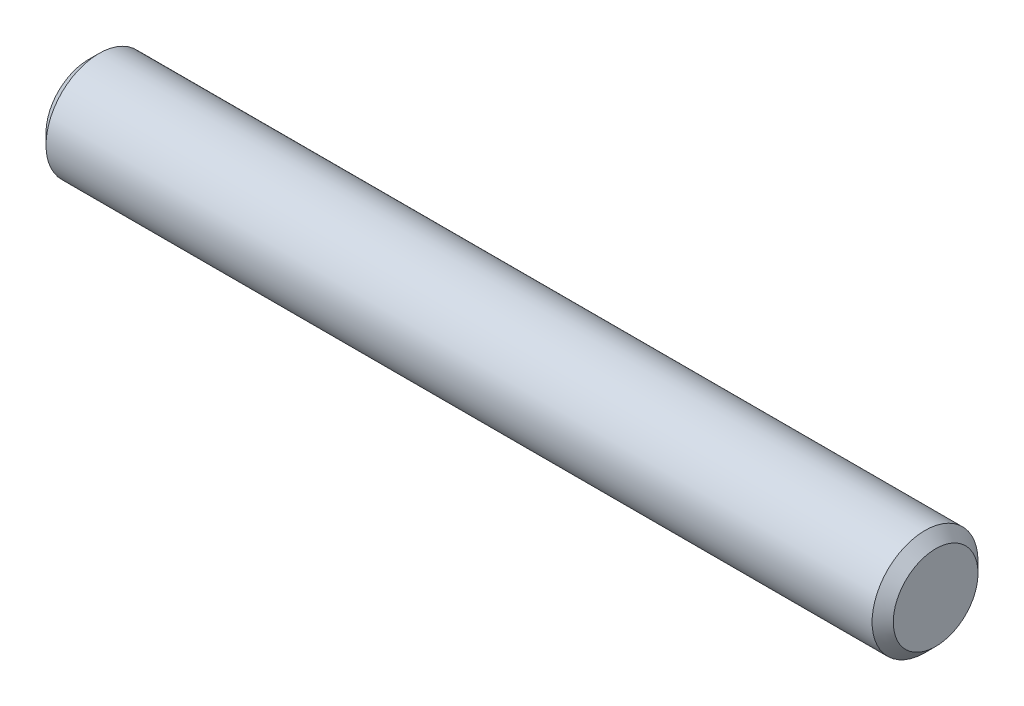
ISO-10303-21;
HEADER;
FILE_DESCRIPTION(('STEP AP214'),'2;1');
FILE_NAME('part.step','',(''),(''),'','','');
FILE_SCHEMA(('AUTOMOTIVE_DESIGN { 1 0 10303 214 1 1 1 1 }'));
ENDSEC;
DATA;
#1=APPLICATION_CONTEXT('core data for automotive mechanical design processes');
#2=APPLICATION_PROTOCOL_DEFINITION('international standard','automotive_design',2000,#1);
#3=PRODUCT_CONTEXT('',#1,'mechanical');
#4=PRODUCT('Part','Part','',(#3));
#5=PRODUCT_RELATED_PRODUCT_CATEGORY('part','',(#4));
#6=PRODUCT_DEFINITION_FORMATION('','',#4);
#7=PRODUCT_DEFINITION_CONTEXT('part definition',#1,'design');
#8=PRODUCT_DEFINITION('design','',#6,#7);
#9=PRODUCT_DEFINITION_SHAPE('','',#8);
#10=(LENGTH_UNIT() NAMED_UNIT(*) SI_UNIT(.MILLI.,.METRE.));
#11=(NAMED_UNIT(*) PLANE_ANGLE_UNIT() SI_UNIT($,.RADIAN.));
#12=(NAMED_UNIT(*) SI_UNIT($,.STERADIAN.) SOLID_ANGLE_UNIT());
#13=UNCERTAINTY_MEASURE_WITH_UNIT(LENGTH_MEASURE(1.E-05),#10,'distance_accuracy_value','');
#14=(GEOMETRIC_REPRESENTATION_CONTEXT(3) GLOBAL_UNCERTAINTY_ASSIGNED_CONTEXT((#13)) GLOBAL_UNIT_ASSIGNED_CONTEXT((#10,
#11,#12)) REPRESENTATION_CONTEXT('',''));
#15=CARTESIAN_POINT('',(0.,0.,0.));
#16=DIRECTION('',(0.,0.,1.));
#17=DIRECTION('',(1.,0.,0.));
#18=AXIS2_PLACEMENT_3D('',#15,#16,#17);
#19=CARTESIAN_POINT('',(-12.7,0.,0.));
#20=DIRECTION('',(1.,0.,0.));
#21=DIRECTION('',(0.,0.,-1.));
#22=AXIS2_PLACEMENT_3D('',#19,#20,#21);
#23=CYLINDRICAL_SURFACE('',#22,1.5875);
#24=CARTESIAN_POINT('',(12.3825,0.,0.));
#25=DIRECTION('',(1.,0.,0.));
#26=DIRECTION('',(0.,0.,-1.));
#27=AXIS2_PLACEMENT_3D('',#24,#25,#26);
#28=CIRCLE('',#27,1.5875);
#29=CARTESIAN_POINT('',(12.3825,0.,-1.5875));
#30=VERTEX_POINT('',#29);
#31=EDGE_CURVE('E54',#30,#30,#28,.F.);
#32=ORIENTED_EDGE('',*,*,#31,.T.);
#33=EDGE_LOOP('',(#32));
#34=FACE_BOUND('',#33,.T.);
#35=CARTESIAN_POINT('',(-12.3825,0.,0.));
#36=DIRECTION('',(1.,0.,0.));
#37=DIRECTION('',(0.,0.,-1.));
#38=AXIS2_PLACEMENT_3D('',#35,#36,#37);
#39=CIRCLE('',#38,1.5875);
#40=CARTESIAN_POINT('',(-12.3825,0.,-1.5875));
#41=VERTEX_POINT('',#40);
#42=EDGE_CURVE('E58',#41,#41,#39,.T.);
#43=ORIENTED_EDGE('',*,*,#42,.T.);
#44=EDGE_LOOP('',(#43));
#45=FACE_BOUND('',#44,.T.);
#46=ADVANCED_FACE('F47',(#34,#45),#23,.T.);
#47=CARTESIAN_POINT('',(-12.7,0.,0.));
#48=DIRECTION('',(1.,0.,0.));
#49=DIRECTION('',(0.,0.,-1.));
#50=AXIS2_PLACEMENT_3D('',#47,#48,#49);
#51=PLANE('',#50);
#52=CARTESIAN_POINT('',(-12.7,0.,0.));
#53=DIRECTION('',(1.,0.,0.));
#54=DIRECTION('',(0.,0.,-1.));
#55=AXIS2_PLACEMENT_3D('',#52,#53,#54);
#56=CIRCLE('',#55,1.26999999999999);
#57=CARTESIAN_POINT('',(-12.7,0.,-1.26999999999999));
#58=VERTEX_POINT('',#57);
#59=EDGE_CURVE('E12',#58,#58,#56,.F.);
#60=ORIENTED_EDGE('',*,*,#59,.T.);
#61=EDGE_LOOP('',(#60));
#62=FACE_BOUND('',#61,.T.);
#63=ADVANCED_FACE('F78',(#62),#51,.F.);
#64=CARTESIAN_POINT('',(12.7,0.,0.));
#65=DIRECTION('',(1.,0.,0.));
#66=DIRECTION('',(0.,0.,-1.));
#67=AXIS2_PLACEMENT_3D('',#64,#65,#66);
#68=PLANE('',#67);
#69=CARTESIAN_POINT('',(12.7,0.,0.));
#70=DIRECTION('',(1.,0.,0.));
#71=DIRECTION('',(0.,0.,-1.));
#72=AXIS2_PLACEMENT_3D('',#69,#70,#71);
#73=CIRCLE('',#72,1.27);
#74=CARTESIAN_POINT('',(12.7,0.,-1.27));
#75=VERTEX_POINT('',#74);
#76=EDGE_CURVE('E62',#75,#75,#73,.T.);
#77=ORIENTED_EDGE('',*,*,#76,.T.);
#78=EDGE_LOOP('',(#77));
#79=FACE_BOUND('',#78,.T.);
#80=ADVANCED_FACE('F68',(#79),#68,.T.);
#81=CARTESIAN_POINT('',(12.7,0.,0.));
#82=DIRECTION('',(-1.,0.,0.));
#83=DIRECTION('',(0.,0.,1.));
#84=AXIS2_PLACEMENT_3D('',#81,#82,#83);
#85=CONICAL_SURFACE('',#84,1.27,0.78539816339745);
#86=ORIENTED_EDGE('',*,*,#31,.F.);
#87=EDGE_LOOP('',(#86));
#88=FACE_BOUND('',#87,.T.);
#89=ORIENTED_EDGE('',*,*,#76,.F.);
#90=EDGE_LOOP('',(#89));
#91=FACE_BOUND('',#90,.T.);
#92=ADVANCED_FACE('F70',(#88,#91),#85,.T.);
#93=CARTESIAN_POINT('',(-12.3825,0.,0.));
#94=DIRECTION('',(1.,0.,0.));
#95=DIRECTION('',(0.,0.,-1.));
#96=AXIS2_PLACEMENT_3D('',#93,#94,#95);
#97=CONICAL_SURFACE('',#96,1.5875,0.78539816339745);
#98=ORIENTED_EDGE('',*,*,#59,.F.);
#99=EDGE_LOOP('',(#98));
#100=FACE_BOUND('',#99,.T.);
#101=ORIENTED_EDGE('',*,*,#42,.F.);
#102=EDGE_LOOP('',(#101));
#103=FACE_BOUND('',#102,.T.);
#104=ADVANCED_FACE('F49',(#100,#103),#97,.T.);
#105=CLOSED_SHELL('',(#46,#63,#80,#92,#104));
#106=MANIFOLD_SOLID_BREP('B2',#105);
#107=ADVANCED_BREP_SHAPE_REPRESENTATION('',(#18,#106),#14);
#108=SHAPE_DEFINITION_REPRESENTATION(#9,#107);
ENDSEC;
END-ISO-10303-21;
